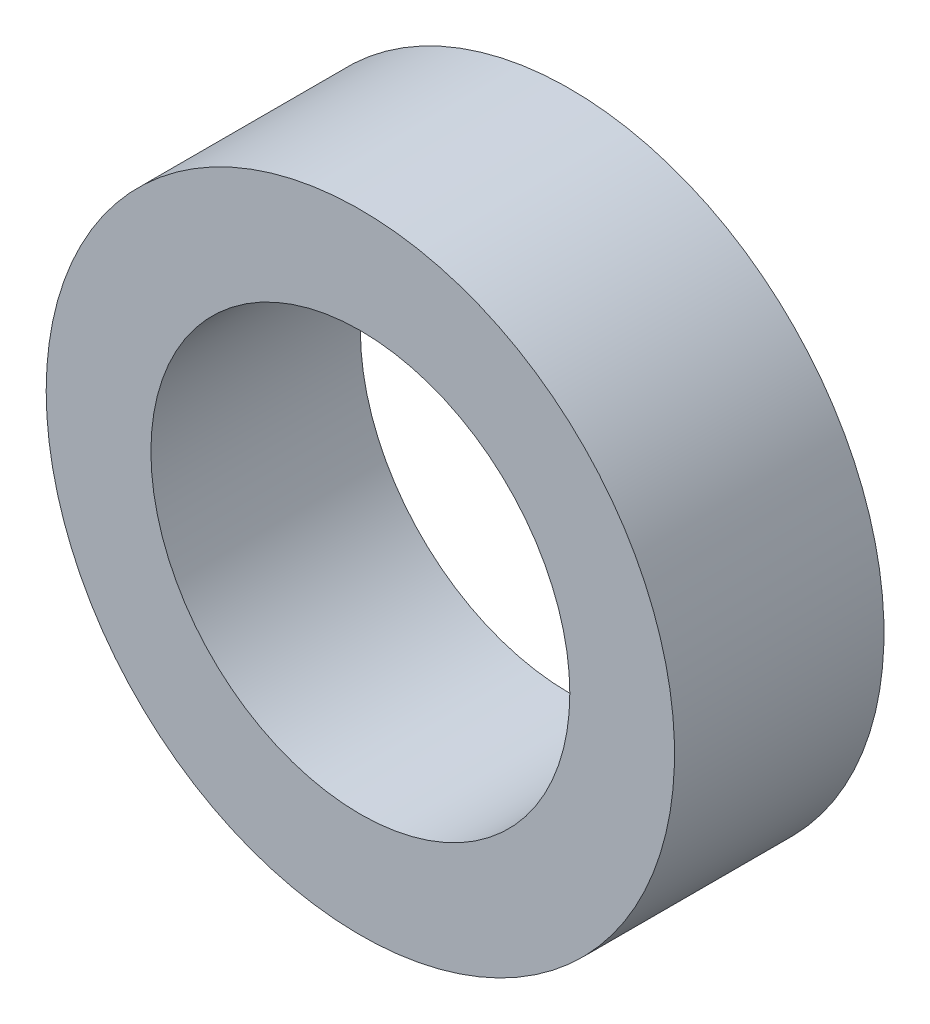
ISO-10303-21;
HEADER;
FILE_DESCRIPTION(('STEP AP214'),'2;1');
FILE_NAME('part.step','',(''),(''),'','','');
FILE_SCHEMA(('AUTOMOTIVE_DESIGN { 1 0 10303 214 1 1 1 1 }'));
ENDSEC;
DATA;
#1=APPLICATION_CONTEXT('core data for automotive mechanical design processes');
#2=APPLICATION_PROTOCOL_DEFINITION('international standard','automotive_design',2000,#1);
#3=PRODUCT_CONTEXT('',#1,'mechanical');
#4=PRODUCT('Part','Part','',(#3));
#5=PRODUCT_RELATED_PRODUCT_CATEGORY('part','',(#4));
#6=PRODUCT_DEFINITION_FORMATION('','',#4);
#7=PRODUCT_DEFINITION_CONTEXT('part definition',#1,'design');
#8=PRODUCT_DEFINITION('design','',#6,#7);
#9=PRODUCT_DEFINITION_SHAPE('','',#8);
#10=(LENGTH_UNIT() NAMED_UNIT(*) SI_UNIT(.MILLI.,.METRE.));
#11=(NAMED_UNIT(*) PLANE_ANGLE_UNIT() SI_UNIT($,.RADIAN.));
#12=(NAMED_UNIT(*) SI_UNIT($,.STERADIAN.) SOLID_ANGLE_UNIT());
#13=UNCERTAINTY_MEASURE_WITH_UNIT(LENGTH_MEASURE(1.E-05),#10,'distance_accuracy_value','');
#14=(GEOMETRIC_REPRESENTATION_CONTEXT(3) GLOBAL_UNCERTAINTY_ASSIGNED_CONTEXT((#13)) GLOBAL_UNIT_ASSIGNED_CONTEXT((#10,
#11,#12)) REPRESENTATION_CONTEXT('',''));
#15=CARTESIAN_POINT('',(0.,0.,0.));
#16=DIRECTION('',(0.,0.,1.));
#17=DIRECTION('',(1.,0.,0.));
#18=AXIS2_PLACEMENT_3D('',#15,#16,#17);
#19=CARTESIAN_POINT('',(-40.,10.,10.));
#20=DIRECTION('',(0.,0.,-1.));
#21=DIRECTION('',(-1.,0.,0.));
#22=AXIS2_PLACEMENT_3D('',#19,#20,#21);
#23=PLANE('',#22);
#24=CARTESIAN_POINT('',(-40.,10.,10.));
#25=DIRECTION('',(0.,0.,-1.));
#26=DIRECTION('',(-1.,0.,0.));
#27=AXIS2_PLACEMENT_3D('',#24,#25,#26);
#28=CIRCLE('',#27,15.);
#29=CARTESIAN_POINT('',(-55.,10.,10.));
#30=VERTEX_POINT('',#29);
#31=EDGE_CURVE('E11',#30,#30,#28,.F.);
#32=ORIENTED_EDGE('',*,*,#31,.T.);
#33=EDGE_LOOP('',(#32));
#34=FACE_BOUND('',#33,.T.);
#35=CARTESIAN_POINT('',(-40.,10.,10.));
#36=DIRECTION('',(0.,0.,1.));
#37=DIRECTION('',(-1.,0.,0.));
#38=AXIS2_PLACEMENT_3D('',#35,#36,#37);
#39=CIRCLE('',#38,10.);
#40=CARTESIAN_POINT('',(-50.,10.,10.));
#41=VERTEX_POINT('',#40);
#42=EDGE_CURVE('E56',#41,#41,#39,.T.);
#43=ORIENTED_EDGE('',*,*,#42,.F.);
#44=EDGE_LOOP('',(#43));
#45=FACE_BOUND('',#44,.T.);
#46=ADVANCED_FACE('F45',(#34,#45),#23,.F.);
#47=CARTESIAN_POINT('',(-40.,10.,0.));
#48=DIRECTION('',(0.,0.,-1.));
#49=DIRECTION('',(-1.,0.,0.));
#50=AXIS2_PLACEMENT_3D('',#47,#48,#49);
#51=PLANE('',#50);
#52=CARTESIAN_POINT('',(-40.,10.,0.));
#53=DIRECTION('',(0.,0.,-1.));
#54=DIRECTION('',(-1.,0.,0.));
#55=AXIS2_PLACEMENT_3D('',#52,#53,#54);
#56=CIRCLE('',#55,15.);
#57=CARTESIAN_POINT('',(-55.,10.,0.));
#58=VERTEX_POINT('',#57);
#59=EDGE_CURVE('E49',#58,#58,#56,.F.);
#60=ORIENTED_EDGE('',*,*,#59,.F.);
#61=EDGE_LOOP('',(#60));
#62=FACE_BOUND('',#61,.T.);
#63=CARTESIAN_POINT('',(-40.,10.,0.));
#64=DIRECTION('',(0.,0.,1.));
#65=DIRECTION('',(-1.,0.,0.));
#66=AXIS2_PLACEMENT_3D('',#63,#64,#65);
#67=CIRCLE('',#66,10.);
#68=CARTESIAN_POINT('',(-50.,10.,0.));
#69=VERTEX_POINT('',#68);
#70=EDGE_CURVE('E58',#69,#69,#67,.T.);
#71=ORIENTED_EDGE('',*,*,#70,.T.);
#72=EDGE_LOOP('',(#71));
#73=FACE_BOUND('',#72,.T.);
#74=ADVANCED_FACE('F67',(#62,#73),#51,.T.);
#75=CARTESIAN_POINT('',(-40.,10.,10.));
#76=DIRECTION('',(0.,0.,-1.));
#77=DIRECTION('',(-1.,0.,0.));
#78=AXIS2_PLACEMENT_3D('',#75,#76,#77);
#79=CYLINDRICAL_SURFACE('',#78,15.);
#80=ORIENTED_EDGE('',*,*,#59,.T.);
#81=EDGE_LOOP('',(#80));
#82=FACE_BOUND('',#81,.T.);
#83=ORIENTED_EDGE('',*,*,#31,.F.);
#84=EDGE_LOOP('',(#83));
#85=FACE_BOUND('',#84,.T.);
#86=ADVANCED_FACE('F47',(#82,#85),#79,.T.);
#87=CARTESIAN_POINT('',(-40.,10.,10.));
#88=DIRECTION('',(0.,0.,-1.));
#89=DIRECTION('',(-1.,0.,0.));
#90=AXIS2_PLACEMENT_3D('',#87,#88,#89);
#91=CYLINDRICAL_SURFACE('',#90,10.);
#92=ORIENTED_EDGE('',*,*,#70,.F.);
#93=EDGE_LOOP('',(#92));
#94=FACE_BOUND('',#93,.T.);
#95=ORIENTED_EDGE('',*,*,#42,.T.);
#96=EDGE_LOOP('',(#95));
#97=FACE_BOUND('',#96,.T.);
#98=ADVANCED_FACE('F64',(#94,#97),#91,.F.);
#99=CLOSED_SHELL('',(#46,#74,#86,#98));
#100=MANIFOLD_SOLID_BREP('B2',#99);
#101=ADVANCED_BREP_SHAPE_REPRESENTATION('',(#18,#100),#14);
#102=SHAPE_DEFINITION_REPRESENTATION(#9,#101);
ENDSEC;
END-ISO-10303-21;
